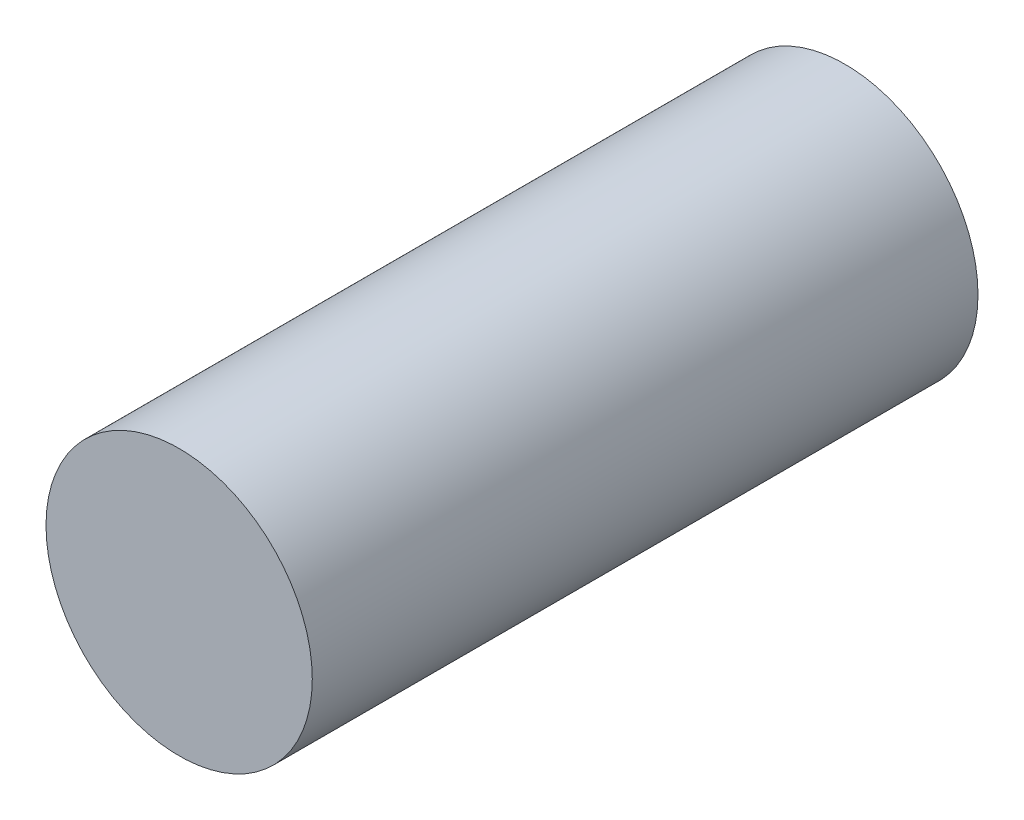
ISO-10303-21;
HEADER;
FILE_DESCRIPTION(('STEP AP214'),'2;1');
FILE_NAME('part.step','',(''),(''),'','','');
FILE_SCHEMA(('AUTOMOTIVE_DESIGN { 1 0 10303 214 1 1 1 1 }'));
ENDSEC;
DATA;
#1=APPLICATION_CONTEXT('core data for automotive mechanical design processes');
#2=APPLICATION_PROTOCOL_DEFINITION('international standard','automotive_design',2000,#1);
#3=PRODUCT_CONTEXT('',#1,'mechanical');
#4=PRODUCT('Part','Part','',(#3));
#5=PRODUCT_RELATED_PRODUCT_CATEGORY('part','',(#4));
#6=PRODUCT_DEFINITION_FORMATION('','',#4);
#7=PRODUCT_DEFINITION_CONTEXT('part definition',#1,'design');
#8=PRODUCT_DEFINITION('design','',#6,#7);
#9=PRODUCT_DEFINITION_SHAPE('','',#8);
#10=(LENGTH_UNIT() NAMED_UNIT(*) SI_UNIT(.MILLI.,.METRE.));
#11=(NAMED_UNIT(*) PLANE_ANGLE_UNIT() SI_UNIT($,.RADIAN.));
#12=(NAMED_UNIT(*) SI_UNIT($,.STERADIAN.) SOLID_ANGLE_UNIT());
#13=UNCERTAINTY_MEASURE_WITH_UNIT(LENGTH_MEASURE(1.E-05),#10,'distance_accuracy_value','');
#14=(GEOMETRIC_REPRESENTATION_CONTEXT(3) GLOBAL_UNCERTAINTY_ASSIGNED_CONTEXT((#13)) GLOBAL_UNIT_ASSIGNED_CONTEXT((#10,
#11,#12)) REPRESENTATION_CONTEXT('',''));
#15=CARTESIAN_POINT('',(0.,0.,0.));
#16=DIRECTION('',(0.,0.,1.));
#17=DIRECTION('',(1.,0.,0.));
#18=AXIS2_PLACEMENT_3D('',#15,#16,#17);
#19=CARTESIAN_POINT('',(0.,0.,5.));
#20=DIRECTION('',(0.,0.,-1.));
#21=DIRECTION('',(-1.,0.,0.));
#22=AXIS2_PLACEMENT_3D('',#19,#20,#21);
#23=CYLINDRICAL_SURFACE('',#22,1.);
#24=CARTESIAN_POINT('',(0.,0.,5.));
#25=DIRECTION('',(0.,0.,1.));
#26=DIRECTION('',(1.,0.,0.));
#27=AXIS2_PLACEMENT_3D('',#24,#25,#26);
#28=CIRCLE('',#27,1.);
#29=CARTESIAN_POINT('',(1.,0.,5.));
#30=VERTEX_POINT('',#29);
#31=EDGE_CURVE('E10',#30,#30,#28,.T.);
#32=ORIENTED_EDGE('',*,*,#31,.F.);
#33=EDGE_LOOP('',(#32));
#34=FACE_BOUND('',#33,.T.);
#35=CARTESIAN_POINT('',(0.,0.,0.));
#36=DIRECTION('',(0.,0.,1.));
#37=DIRECTION('',(1.,0.,0.));
#38=AXIS2_PLACEMENT_3D('',#35,#36,#37);
#39=CIRCLE('',#38,1.);
#40=CARTESIAN_POINT('',(1.,0.,0.));
#41=VERTEX_POINT('',#40);
#42=EDGE_CURVE('E40',#41,#41,#39,.T.);
#43=ORIENTED_EDGE('',*,*,#42,.T.);
#44=EDGE_LOOP('',(#43));
#45=FACE_BOUND('',#44,.T.);
#46=ADVANCED_FACE('F37',(#34,#45),#23,.T.);
#47=CARTESIAN_POINT('',(0.,0.,5.));
#48=DIRECTION('',(0.,0.,1.));
#49=DIRECTION('',(1.,0.,0.));
#50=AXIS2_PLACEMENT_3D('',#47,#48,#49);
#51=PLANE('',#50);
#52=ORIENTED_EDGE('',*,*,#31,.T.);
#53=EDGE_LOOP('',(#52));
#54=FACE_BOUND('',#53,.T.);
#55=ADVANCED_FACE('F54',(#54),#51,.T.);
#56=CARTESIAN_POINT('',(0.,0.,0.));
#57=DIRECTION('',(0.,0.,1.));
#58=DIRECTION('',(1.,0.,0.));
#59=AXIS2_PLACEMENT_3D('',#56,#57,#58);
#60=PLANE('',#59);
#61=ORIENTED_EDGE('',*,*,#42,.F.);
#62=EDGE_LOOP('',(#61));
#63=FACE_BOUND('',#62,.T.);
#64=ADVANCED_FACE('F52',(#63),#60,.F.);
#65=CLOSED_SHELL('',(#46,#55,#64));
#66=MANIFOLD_SOLID_BREP('B2',#65);
#67=ADVANCED_BREP_SHAPE_REPRESENTATION('',(#18,#66),#14);
#68=SHAPE_DEFINITION_REPRESENTATION(#9,#67);
ENDSEC;
END-ISO-10303-21;
